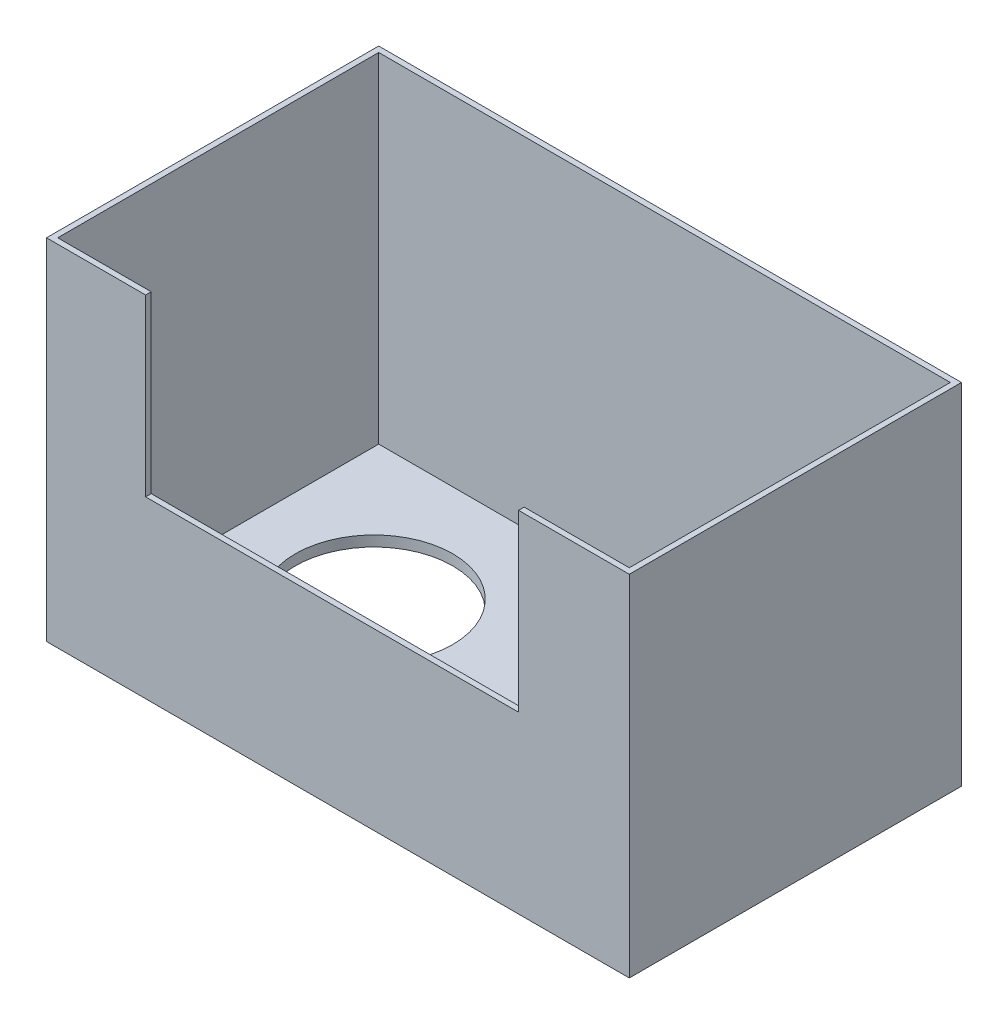
ISO-10303-21;
HEADER;
FILE_DESCRIPTION(('STEP AP214'),'2;1');
FILE_NAME('part.step','',(''),(''),'','','');
FILE_SCHEMA(('AUTOMOTIVE_DESIGN { 1 0 10303 214 1 1 1 1 }'));
ENDSEC;
DATA;
#1=APPLICATION_CONTEXT('core data for automotive mechanical design processes');
#2=APPLICATION_PROTOCOL_DEFINITION('international standard','automotive_design',2000,#1);
#3=PRODUCT_CONTEXT('',#1,'mechanical');
#4=PRODUCT('Part','Part','',(#3));
#5=PRODUCT_RELATED_PRODUCT_CATEGORY('part','',(#4));
#6=PRODUCT_DEFINITION_FORMATION('','',#4);
#7=PRODUCT_DEFINITION_CONTEXT('part definition',#1,'design');
#8=PRODUCT_DEFINITION('design','',#6,#7);
#9=PRODUCT_DEFINITION_SHAPE('','',#8);
#10=(LENGTH_UNIT() NAMED_UNIT(*) SI_UNIT(.MILLI.,.METRE.));
#11=(NAMED_UNIT(*) PLANE_ANGLE_UNIT() SI_UNIT($,.RADIAN.));
#12=(NAMED_UNIT(*) SI_UNIT($,.STERADIAN.) SOLID_ANGLE_UNIT());
#13=UNCERTAINTY_MEASURE_WITH_UNIT(LENGTH_MEASURE(1.E-05),#10,'distance_accuracy_value','');
#14=(GEOMETRIC_REPRESENTATION_CONTEXT(3) GLOBAL_UNCERTAINTY_ASSIGNED_CONTEXT((#13)) GLOBAL_UNIT_ASSIGNED_CONTEXT((#10,
#11,#12)) REPRESENTATION_CONTEXT('',''));
#15=CARTESIAN_POINT('',(0.,0.,0.));
#16=DIRECTION('',(0.,0.,1.));
#17=DIRECTION('',(1.,0.,0.));
#18=AXIS2_PLACEMENT_3D('',#15,#16,#17);
#19=CARTESIAN_POINT('',(-63.5,76.2,-36.195));
#20=DIRECTION('',(1.,0.,0.));
#21=DIRECTION('',(0.,0.,-1.));
#22=AXIS2_PLACEMENT_3D('',#19,#20,#21);
#23=PLANE('',#22);
#24=DIRECTION('',(0.,0.,1.));
#25=VECTOR('',#24,1.);
#26=CARTESIAN_POINT('',(-63.5,0.,-36.195));
#27=LINE('',#26,#25);
#28=CARTESIAN_POINT('',(-63.5,0.,-36.195));
#29=VERTEX_POINT('',#28);
#30=CARTESIAN_POINT('',(-63.5,0.,36.195));
#31=VERTEX_POINT('',#30);
#32=EDGE_CURVE('E185',#29,#31,#27,.T.);
#33=ORIENTED_EDGE('',*,*,#32,.T.);
#34=DIRECTION('',(0.,-1.,0.));
#35=VECTOR('',#34,1.);
#36=CARTESIAN_POINT('',(-63.5,76.2,36.195));
#37=LINE('',#36,#35);
#38=CARTESIAN_POINT('',(-63.5,76.2,36.195));
#39=VERTEX_POINT('',#38);
#40=EDGE_CURVE('E12',#39,#31,#37,.T.);
#41=ORIENTED_EDGE('',*,*,#40,.F.);
#42=DIRECTION('',(0.,0.,1.));
#43=VECTOR('',#42,1.);
#44=CARTESIAN_POINT('',(-63.5,76.2,-36.195));
#45=LINE('',#44,#43);
#46=CARTESIAN_POINT('',(-63.5,76.2,-36.195));
#47=VERTEX_POINT('',#46);
#48=EDGE_CURVE('E186',#47,#39,#45,.T.);
#49=ORIENTED_EDGE('',*,*,#48,.F.);
#50=DIRECTION('',(0.,-1.,0.));
#51=VECTOR('',#50,1.);
#52=CARTESIAN_POINT('',(-63.5,76.2,-36.195));
#53=LINE('',#52,#51);
#54=EDGE_CURVE('E197',#47,#29,#53,.T.);
#55=ORIENTED_EDGE('',*,*,#54,.T.);
#56=EDGE_LOOP('',(#33,#41,#49,#55));
#57=FACE_BOUND('',#56,.T.);
#58=ADVANCED_FACE('F35',(#57),#23,.F.);
#59=CARTESIAN_POINT('',(-63.5,76.2,36.195));
#60=DIRECTION('',(0.,0.,-1.));
#61=DIRECTION('',(-1.,0.,0.));
#62=AXIS2_PLACEMENT_3D('',#59,#60,#61);
#63=PLANE('',#62);
#64=DIRECTION('',(1.,0.,0.));
#65=VECTOR('',#64,1.);
#66=CARTESIAN_POINT('',(-41.91,38.1,36.195));
#67=LINE('',#66,#65);
#68=CARTESIAN_POINT('',(-41.91,38.1,36.195));
#69=VERTEX_POINT('',#68);
#70=CARTESIAN_POINT('',(39.37,38.1,36.195));
#71=VERTEX_POINT('',#70);
#72=EDGE_CURVE('E126',#69,#71,#67,.T.);
#73=ORIENTED_EDGE('',*,*,#72,.F.);
#74=DIRECTION('',(0.,-1.,0.));
#75=VECTOR('',#74,1.);
#76=CARTESIAN_POINT('',(-41.91,76.2,36.195));
#77=LINE('',#76,#75);
#78=CARTESIAN_POINT('',(-41.91,76.2,36.195));
#79=VERTEX_POINT('',#78);
#80=EDGE_CURVE('E135',#79,#69,#77,.T.);
#81=ORIENTED_EDGE('',*,*,#80,.F.);
#82=DIRECTION('',(1.,0.,0.));
#83=VECTOR('',#82,1.);
#84=CARTESIAN_POINT('',(-63.5,76.2,36.195));
#85=LINE('',#84,#83);
#86=EDGE_CURVE('E191',#39,#79,#85,.T.);
#87=ORIENTED_EDGE('',*,*,#86,.F.);
#88=ORIENTED_EDGE('',*,*,#40,.T.);
#89=DIRECTION('',(1.,0.,0.));
#90=VECTOR('',#89,1.);
#91=CARTESIAN_POINT('',(-63.5,0.,36.195));
#92=LINE('',#91,#90);
#93=CARTESIAN_POINT('',(63.5,0.,36.195));
#94=VERTEX_POINT('',#93);
#95=EDGE_CURVE('E200',#31,#94,#92,.T.);
#96=ORIENTED_EDGE('',*,*,#95,.T.);
#97=DIRECTION('',(0.,-1.,0.));
#98=VECTOR('',#97,1.);
#99=CARTESIAN_POINT('',(63.5,76.2,36.195));
#100=LINE('',#99,#98);
#101=CARTESIAN_POINT('',(63.5,76.2,36.195));
#102=VERTEX_POINT('',#101);
#103=EDGE_CURVE('E42',#102,#94,#100,.T.);
#104=ORIENTED_EDGE('',*,*,#103,.F.);
#105=CARTESIAN_POINT('',(39.37,76.2,36.195));
#106=VERTEX_POINT('',#105);
#107=EDGE_CURVE('E189',#106,#102,#85,.T.);
#108=ORIENTED_EDGE('',*,*,#107,.F.);
#109=DIRECTION('',(0.,1.,0.));
#110=VECTOR('',#109,1.);
#111=CARTESIAN_POINT('',(39.37,76.2,36.195));
#112=LINE('',#111,#110);
#113=EDGE_CURVE('E132',#71,#106,#112,.T.);
#114=ORIENTED_EDGE('',*,*,#113,.F.);
#115=EDGE_LOOP('',(#73,#81,#87,#88,#96,#104,#108,#114));
#116=FACE_BOUND('',#115,.T.);
#117=ADVANCED_FACE('F143',(#116),#63,.F.);
#118=CARTESIAN_POINT('',(63.5,76.2,-36.195));
#119=DIRECTION('',(-1.,0.,0.));
#120=DIRECTION('',(0.,0.,1.));
#121=AXIS2_PLACEMENT_3D('',#118,#119,#120);
#122=PLANE('',#121);
#123=DIRECTION('',(0.,0.,-1.));
#124=VECTOR('',#123,1.);
#125=CARTESIAN_POINT('',(63.5,0.,-36.195));
#126=LINE('',#125,#124);
#127=CARTESIAN_POINT('',(63.5,0.,-36.195));
#128=VERTEX_POINT('',#127);
#129=EDGE_CURVE('E202',#94,#128,#126,.T.);
#130=ORIENTED_EDGE('',*,*,#129,.T.);
#131=DIRECTION('',(0.,-1.,0.));
#132=VECTOR('',#131,1.);
#133=CARTESIAN_POINT('',(63.5,76.2,-36.195));
#134=LINE('',#133,#132);
#135=CARTESIAN_POINT('',(63.5,76.2,-36.195));
#136=VERTEX_POINT('',#135);
#137=EDGE_CURVE('E207',#136,#128,#134,.T.);
#138=ORIENTED_EDGE('',*,*,#137,.F.);
#139=DIRECTION('',(0.,0.,-1.));
#140=VECTOR('',#139,1.);
#141=CARTESIAN_POINT('',(63.5,76.2,-36.195));
#142=LINE('',#141,#140);
#143=EDGE_CURVE('E193',#102,#136,#142,.T.);
#144=ORIENTED_EDGE('',*,*,#143,.F.);
#145=ORIENTED_EDGE('',*,*,#103,.T.);
#146=EDGE_LOOP('',(#130,#138,#144,#145));
#147=FACE_BOUND('',#146,.T.);
#148=ADVANCED_FACE('F214',(#147),#122,.F.);
#149=CARTESIAN_POINT('',(-63.5,76.2,-36.195));
#150=DIRECTION('',(0.,0.,1.));
#151=DIRECTION('',(1.,0.,0.));
#152=AXIS2_PLACEMENT_3D('',#149,#150,#151);
#153=PLANE('',#152);
#154=DIRECTION('',(-1.,0.,0.));
#155=VECTOR('',#154,1.);
#156=CARTESIAN_POINT('',(-63.5,0.,-36.195));
#157=LINE('',#156,#155);
#158=EDGE_CURVE('E190',#128,#29,#157,.T.);
#159=ORIENTED_EDGE('',*,*,#158,.T.);
#160=ORIENTED_EDGE('',*,*,#54,.F.);
#161=DIRECTION('',(-1.,0.,0.));
#162=VECTOR('',#161,1.);
#163=CARTESIAN_POINT('',(-63.5,76.2,-36.195));
#164=LINE('',#163,#162);
#165=EDGE_CURVE('E195',#136,#47,#164,.T.);
#166=ORIENTED_EDGE('',*,*,#165,.F.);
#167=ORIENTED_EDGE('',*,*,#137,.T.);
#168=EDGE_LOOP('',(#159,#160,#166,#167));
#169=FACE_BOUND('',#168,.T.);
#170=ADVANCED_FACE('F222',(#169),#153,.F.);
#171=CARTESIAN_POINT('',(0.,76.2,0.));
#172=DIRECTION('',(0.,1.,0.));
#173=DIRECTION('',(0.,0.,1.));
#174=AXIS2_PLACEMENT_3D('',#171,#172,#173);
#175=PLANE('',#174);
#176=DIRECTION('',(0.,0.,1.));
#177=VECTOR('',#176,1.);
#178=CARTESIAN_POINT('',(-41.91,76.2,-54.7908329991273));
#179=LINE('',#178,#177);
#180=CARTESIAN_POINT('',(-41.91,76.2,34.9758));
#181=VERTEX_POINT('',#180);
#182=EDGE_CURVE('E138',#181,#79,#179,.T.);
#183=ORIENTED_EDGE('',*,*,#182,.F.);
#184=DIRECTION('',(1.,0.,0.));
#185=VECTOR('',#184,1.);
#186=CARTESIAN_POINT('',(-62.2808,76.2,34.9758));
#187=LINE('',#186,#185);
#188=CARTESIAN_POINT('',(-62.2808,76.2,34.9758));
#189=VERTEX_POINT('',#188);
#190=EDGE_CURVE('E170',#189,#181,#187,.T.);
#191=ORIENTED_EDGE('',*,*,#190,.F.);
#192=DIRECTION('',(0.,0.,1.));
#193=VECTOR('',#192,1.);
#194=CARTESIAN_POINT('',(-62.2808,76.2,-34.9758));
#195=LINE('',#194,#193);
#196=CARTESIAN_POINT('',(-62.2808,76.2,-34.9758));
#197=VERTEX_POINT('',#196);
#198=EDGE_CURVE('E166',#197,#189,#195,.T.);
#199=ORIENTED_EDGE('',*,*,#198,.F.);
#200=DIRECTION('',(-1.,0.,0.));
#201=VECTOR('',#200,1.);
#202=CARTESIAN_POINT('',(62.2808,76.2,-34.9758));
#203=LINE('',#202,#201);
#204=CARTESIAN_POINT('',(62.2808,76.2,-34.9758));
#205=VERTEX_POINT('',#204);
#206=EDGE_CURVE('E57',#205,#197,#203,.T.);
#207=ORIENTED_EDGE('',*,*,#206,.F.);
#208=DIRECTION('',(0.,0.,-1.));
#209=VECTOR('',#208,1.);
#210=CARTESIAN_POINT('',(62.2808,76.2,34.9758));
#211=LINE('',#210,#209);
#212=CARTESIAN_POINT('',(62.2808,76.2,34.9758));
#213=VERTEX_POINT('',#212);
#214=EDGE_CURVE('E173',#213,#205,#211,.T.);
#215=ORIENTED_EDGE('',*,*,#214,.F.);
#216=CARTESIAN_POINT('',(39.37,76.2,34.9758));
#217=VERTEX_POINT('',#216);
#218=EDGE_CURVE('E169',#217,#213,#187,.T.);
#219=ORIENTED_EDGE('',*,*,#218,.F.);
#220=DIRECTION('',(0.,0.,1.));
#221=VECTOR('',#220,1.);
#222=CARTESIAN_POINT('',(39.37,76.2,-54.7908329991273));
#223=LINE('',#222,#221);
#224=EDGE_CURVE('E151',#217,#106,#223,.T.);
#225=ORIENTED_EDGE('',*,*,#224,.T.);
#226=ORIENTED_EDGE('',*,*,#107,.T.);
#227=ORIENTED_EDGE('',*,*,#143,.T.);
#228=ORIENTED_EDGE('',*,*,#165,.T.);
#229=ORIENTED_EDGE('',*,*,#48,.T.);
#230=ORIENTED_EDGE('',*,*,#86,.T.);
#231=EDGE_LOOP('',(#183,#191,#199,#207,#215,#219,#225,#226,#227,#228,#229,#230));
#232=FACE_BOUND('',#231,.T.);
#233=ADVANCED_FACE('F228',(#232),#175,.T.);
#234=CARTESIAN_POINT('',(0.,0.,0.));
#235=DIRECTION('',(0.,1.,0.));
#236=DIRECTION('',(0.,0.,1.));
#237=AXIS2_PLACEMENT_3D('',#234,#235,#236);
#238=PLANE('',#237);
#239=CARTESIAN_POINT('',(-33.528,0.,-5.207));
#240=DIRECTION('',(0.,-1.,0.));
#241=DIRECTION('',(0.,0.,-1.));
#242=AXIS2_PLACEMENT_3D('',#239,#240,#241);
#243=CIRCLE('',#242,17.145);
#244=CARTESIAN_POINT('',(-33.528,0.,-22.352));
#245=VERTEX_POINT('',#244);
#246=EDGE_CURVE('E242',#245,#245,#243,.T.);
#247=ORIENTED_EDGE('',*,*,#246,.F.);
#248=EDGE_LOOP('',(#247));
#249=FACE_BOUND('',#248,.T.);
#250=CARTESIAN_POINT('',(33.528,0.,-5.207));
#251=DIRECTION('',(0.,-1.,0.));
#252=DIRECTION('',(0.,0.,1.));
#253=AXIS2_PLACEMENT_3D('',#250,#251,#252);
#254=CIRCLE('',#253,17.145);
#255=CARTESIAN_POINT('',(33.528,0.,11.938));
#256=VERTEX_POINT('',#255);
#257=EDGE_CURVE('E243',#256,#256,#254,.T.);
#258=ORIENTED_EDGE('',*,*,#257,.F.);
#259=EDGE_LOOP('',(#258));
#260=FACE_BOUND('',#259,.T.);
#261=ORIENTED_EDGE('',*,*,#32,.F.);
#262=ORIENTED_EDGE('',*,*,#158,.F.);
#263=ORIENTED_EDGE('',*,*,#129,.F.);
#264=ORIENTED_EDGE('',*,*,#95,.F.);
#265=EDGE_LOOP('',(#261,#262,#263,#264));
#266=FACE_BOUND('',#265,.T.);
#267=ADVANCED_FACE('F219',(#249,#260,#266),#238,.F.);
#268=CARTESIAN_POINT('',(62.2808,-142.859436290082,-34.9758));
#269=DIRECTION('',(0.,0.,-1.));
#270=DIRECTION('',(-1.,0.,0.));
#271=AXIS2_PLACEMENT_3D('',#268,#269,#270);
#272=PLANE('',#271);
#273=DIRECTION('',(1.,0.,0.));
#274=VECTOR('',#273,1.);
#275=CARTESIAN_POINT('',(62.2808,2.28600000000001,-34.9758));
#276=LINE('',#275,#274);
#277=CARTESIAN_POINT('',(-62.2808,2.28600000000001,-34.9758));
#278=VERTEX_POINT('',#277);
#279=CARTESIAN_POINT('',(62.2808,2.28600000000001,-34.9758));
#280=VERTEX_POINT('',#279);
#281=EDGE_CURVE('E162',#278,#280,#276,.T.);
#282=ORIENTED_EDGE('',*,*,#281,.T.);
#283=DIRECTION('',(0.,1.,0.));
#284=VECTOR('',#283,1.);
#285=CARTESIAN_POINT('',(62.2808,-142.859436290082,-34.9758));
#286=LINE('',#285,#284);
#287=EDGE_CURVE('E160',#280,#205,#286,.T.);
#288=ORIENTED_EDGE('',*,*,#287,.T.);
#289=ORIENTED_EDGE('',*,*,#206,.T.);
#290=DIRECTION('',(0.,1.,0.));
#291=VECTOR('',#290,1.);
#292=CARTESIAN_POINT('',(-62.2808,-142.859436290082,-34.9758));
#293=LINE('',#292,#291);
#294=EDGE_CURVE('E176',#278,#197,#293,.T.);
#295=ORIENTED_EDGE('',*,*,#294,.F.);
#296=EDGE_LOOP('',(#282,#288,#289,#295));
#297=FACE_BOUND('',#296,.T.);
#298=ADVANCED_FACE('F256',(#297),#272,.F.);
#299=CARTESIAN_POINT('',(62.2808,-142.859436290082,34.9758));
#300=DIRECTION('',(1.,0.,0.));
#301=DIRECTION('',(0.,0.,-1.));
#302=AXIS2_PLACEMENT_3D('',#299,#300,#301);
#303=PLANE('',#302);
#304=DIRECTION('',(0.,0.,1.));
#305=VECTOR('',#304,1.);
#306=CARTESIAN_POINT('',(62.2808,2.28600000000001,34.9758));
#307=LINE('',#306,#305);
#308=CARTESIAN_POINT('',(62.2808,2.28600000000001,34.9758));
#309=VERTEX_POINT('',#308);
#310=EDGE_CURVE('E159',#280,#309,#307,.T.);
#311=ORIENTED_EDGE('',*,*,#310,.T.);
#312=DIRECTION('',(0.,1.,0.));
#313=VECTOR('',#312,1.);
#314=CARTESIAN_POINT('',(62.2808,-142.859436290082,34.9758));
#315=LINE('',#314,#313);
#316=EDGE_CURVE('E178',#309,#213,#315,.T.);
#317=ORIENTED_EDGE('',*,*,#316,.T.);
#318=ORIENTED_EDGE('',*,*,#214,.T.);
#319=ORIENTED_EDGE('',*,*,#287,.F.);
#320=EDGE_LOOP('',(#311,#317,#318,#319));
#321=FACE_BOUND('',#320,.T.);
#322=ADVANCED_FACE('F282',(#321),#303,.F.);
#323=CARTESIAN_POINT('',(-62.2808,-142.859436290082,34.9758));
#324=DIRECTION('',(0.,0.,1.));
#325=DIRECTION('',(1.,0.,0.));
#326=AXIS2_PLACEMENT_3D('',#323,#324,#325);
#327=PLANE('',#326);
#328=ORIENTED_EDGE('',*,*,#190,.T.);
#329=DIRECTION('',(0.,1.,0.));
#330=VECTOR('',#329,1.);
#331=CARTESIAN_POINT('',(-41.91,76.2,34.9758));
#332=LINE('',#331,#330);
#333=CARTESIAN_POINT('',(-41.91,38.1,34.9758));
#334=VERTEX_POINT('',#333);
#335=EDGE_CURVE('E156',#334,#181,#332,.T.);
#336=ORIENTED_EDGE('',*,*,#335,.F.);
#337=DIRECTION('',(-1.,0.,0.));
#338=VECTOR('',#337,1.);
#339=CARTESIAN_POINT('',(-41.91,38.1,34.9758));
#340=LINE('',#339,#338);
#341=CARTESIAN_POINT('',(39.37,38.1,34.9758));
#342=VERTEX_POINT('',#341);
#343=EDGE_CURVE('E129',#342,#334,#340,.T.);
#344=ORIENTED_EDGE('',*,*,#343,.F.);
#345=DIRECTION('',(0.,-1.,0.));
#346=VECTOR('',#345,1.);
#347=CARTESIAN_POINT('',(39.37,76.2,34.9758));
#348=LINE('',#347,#346);
#349=EDGE_CURVE('E150',#217,#342,#348,.T.);
#350=ORIENTED_EDGE('',*,*,#349,.F.);
#351=ORIENTED_EDGE('',*,*,#218,.T.);
#352=ORIENTED_EDGE('',*,*,#316,.F.);
#353=DIRECTION('',(-1.,0.,0.));
#354=VECTOR('',#353,1.);
#355=CARTESIAN_POINT('',(-62.2808,2.28600000000001,34.9758));
#356=LINE('',#355,#354);
#357=CARTESIAN_POINT('',(-62.2808,2.28600000000001,34.9758));
#358=VERTEX_POINT('',#357);
#359=EDGE_CURVE('E157',#309,#358,#356,.T.);
#360=ORIENTED_EDGE('',*,*,#359,.T.);
#361=DIRECTION('',(0.,1.,0.));
#362=VECTOR('',#361,1.);
#363=CARTESIAN_POINT('',(-62.2808,-142.859436290082,34.9758));
#364=LINE('',#363,#362);
#365=EDGE_CURVE('E181',#358,#189,#364,.T.);
#366=ORIENTED_EDGE('',*,*,#365,.T.);
#367=EDGE_LOOP('',(#328,#336,#344,#350,#351,#352,#360,#366));
#368=FACE_BOUND('',#367,.T.);
#369=ADVANCED_FACE('F235',(#368),#327,.F.);
#370=CARTESIAN_POINT('',(-62.2808,-142.859436290082,-34.9758));
#371=DIRECTION('',(-1.,0.,0.));
#372=DIRECTION('',(0.,0.,1.));
#373=AXIS2_PLACEMENT_3D('',#370,#371,#372);
#374=PLANE('',#373);
#375=DIRECTION('',(0.,0.,-1.));
#376=VECTOR('',#375,1.);
#377=CARTESIAN_POINT('',(-62.2808,2.28600000000001,-34.9758));
#378=LINE('',#377,#376);
#379=EDGE_CURVE('E164',#358,#278,#378,.T.);
#380=ORIENTED_EDGE('',*,*,#379,.T.);
#381=ORIENTED_EDGE('',*,*,#294,.T.);
#382=ORIENTED_EDGE('',*,*,#198,.T.);
#383=ORIENTED_EDGE('',*,*,#365,.F.);
#384=EDGE_LOOP('',(#380,#381,#382,#383));
#385=FACE_BOUND('',#384,.T.);
#386=ADVANCED_FACE('F269',(#385),#374,.F.);
#387=CARTESIAN_POINT('',(0.,2.286,0.));
#388=DIRECTION('',(0.,1.,0.));
#389=DIRECTION('',(0.,0.,1.));
#390=AXIS2_PLACEMENT_3D('',#387,#388,#389);
#391=PLANE('',#390);
#392=CARTESIAN_POINT('',(-33.528,2.286,-5.207));
#393=DIRECTION('',(0.,1.,0.));
#394=DIRECTION('',(0.,0.,1.));
#395=AXIS2_PLACEMENT_3D('',#392,#393,#394);
#396=CIRCLE('',#395,17.145);
#397=CARTESIAN_POINT('',(-33.528,2.286,11.938));
#398=VERTEX_POINT('',#397);
#399=EDGE_CURVE('E141',#398,#398,#396,.F.);
#400=ORIENTED_EDGE('',*,*,#399,.T.);
#401=EDGE_LOOP('',(#400));
#402=FACE_BOUND('',#401,.T.);
#403=CARTESIAN_POINT('',(33.528,2.286,-5.207));
#404=DIRECTION('',(0.,1.,0.));
#405=DIRECTION('',(0.,0.,1.));
#406=AXIS2_PLACEMENT_3D('',#403,#404,#405);
#407=CIRCLE('',#406,17.145);
#408=CARTESIAN_POINT('',(33.528,2.286,11.938));
#409=VERTEX_POINT('',#408);
#410=EDGE_CURVE('E239',#409,#409,#407,.F.);
#411=ORIENTED_EDGE('',*,*,#410,.T.);
#412=EDGE_LOOP('',(#411));
#413=FACE_BOUND('',#412,.T.);
#414=ORIENTED_EDGE('',*,*,#281,.F.);
#415=ORIENTED_EDGE('',*,*,#379,.F.);
#416=ORIENTED_EDGE('',*,*,#359,.F.);
#417=ORIENTED_EDGE('',*,*,#310,.F.);
#418=EDGE_LOOP('',(#414,#415,#416,#417));
#419=FACE_BOUND('',#418,.T.);
#420=ADVANCED_FACE('F266',(#402,#413,#419),#391,.T.);
#421=CARTESIAN_POINT('',(-41.91,76.2,-54.7908329991273));
#422=DIRECTION('',(-1.,0.,0.));
#423=DIRECTION('',(0.,-1.,0.));
#424=AXIS2_PLACEMENT_3D('',#421,#422,#423);
#425=PLANE('',#424);
#426=ORIENTED_EDGE('',*,*,#335,.T.);
#427=ORIENTED_EDGE('',*,*,#182,.T.);
#428=ORIENTED_EDGE('',*,*,#80,.T.);
#429=DIRECTION('',(0.,0.,1.));
#430=VECTOR('',#429,1.);
#431=CARTESIAN_POINT('',(-41.91,38.1,-54.7908329991273));
#432=LINE('',#431,#430);
#433=EDGE_CURVE('E122',#334,#69,#432,.T.);
#434=ORIENTED_EDGE('',*,*,#433,.F.);
#435=EDGE_LOOP('',(#426,#427,#428,#434));
#436=FACE_BOUND('',#435,.T.);
#437=ADVANCED_FACE('F136',(#436),#425,.F.);
#438=CARTESIAN_POINT('',(39.37,76.2,-54.7908329991273));
#439=DIRECTION('',(1.,0.,0.));
#440=DIRECTION('',(0.,1.,0.));
#441=AXIS2_PLACEMENT_3D('',#438,#439,#440);
#442=PLANE('',#441);
#443=ORIENTED_EDGE('',*,*,#349,.T.);
#444=DIRECTION('',(0.,0.,1.));
#445=VECTOR('',#444,1.);
#446=CARTESIAN_POINT('',(39.37,38.1,-54.7908329991273));
#447=LINE('',#446,#445);
#448=EDGE_CURVE('E49',#342,#71,#447,.T.);
#449=ORIENTED_EDGE('',*,*,#448,.T.);
#450=ORIENTED_EDGE('',*,*,#113,.T.);
#451=ORIENTED_EDGE('',*,*,#224,.F.);
#452=EDGE_LOOP('',(#443,#449,#450,#451));
#453=FACE_BOUND('',#452,.T.);
#454=ADVANCED_FACE('F233',(#453),#442,.F.);
#455=CARTESIAN_POINT('',(-41.91,38.1,-54.7908329991273));
#456=DIRECTION('',(0.,-1.,0.));
#457=DIRECTION('',(0.,0.,-1.));
#458=AXIS2_PLACEMENT_3D('',#455,#456,#457);
#459=PLANE('',#458);
#460=ORIENTED_EDGE('',*,*,#343,.T.);
#461=ORIENTED_EDGE('',*,*,#433,.T.);
#462=ORIENTED_EDGE('',*,*,#72,.T.);
#463=ORIENTED_EDGE('',*,*,#448,.F.);
#464=EDGE_LOOP('',(#460,#461,#462,#463));
#465=FACE_BOUND('',#464,.T.);
#466=ADVANCED_FACE('F124',(#465),#459,.F.);
#467=CARTESIAN_POINT('',(33.528,50.7793830537734,-5.207));
#468=DIRECTION('',(0.,-1.,0.));
#469=DIRECTION('',(0.,0.,-1.));
#470=AXIS2_PLACEMENT_3D('',#467,#468,#469);
#471=CYLINDRICAL_SURFACE('',#470,17.145);
#472=ORIENTED_EDGE('',*,*,#257,.T.);
#473=EDGE_LOOP('',(#472));
#474=FACE_BOUND('',#473,.T.);
#475=ORIENTED_EDGE('',*,*,#410,.F.);
#476=EDGE_LOOP('',(#475));
#477=FACE_BOUND('',#476,.T.);
#478=ADVANCED_FACE('F260',(#474,#477),#471,.F.);
#479=CARTESIAN_POINT('',(-33.528,50.7793830537734,-5.207));
#480=DIRECTION('',(0.,-1.,0.));
#481=DIRECTION('',(0.,0.,-1.));
#482=AXIS2_PLACEMENT_3D('',#479,#480,#481);
#483=CYLINDRICAL_SURFACE('',#482,17.145);
#484=ORIENTED_EDGE('',*,*,#246,.T.);
#485=EDGE_LOOP('',(#484));
#486=FACE_BOUND('',#485,.T.);
#487=ORIENTED_EDGE('',*,*,#399,.F.);
#488=EDGE_LOOP('',(#487));
#489=FACE_BOUND('',#488,.T.);
#490=ADVANCED_FACE('F251',(#486,#489),#483,.F.);
#491=CLOSED_SHELL('',(#58,#117,#148,#170,#233,#267,#298,#322,#369,#386,#420,#437,#454,#466,#478,#490));
#492=MANIFOLD_SOLID_BREP('B2',#491);
#493=ADVANCED_BREP_SHAPE_REPRESENTATION('',(#18,#492),#14);
#494=SHAPE_DEFINITION_REPRESENTATION(#9,#493);
ENDSEC;
END-ISO-10303-21;
